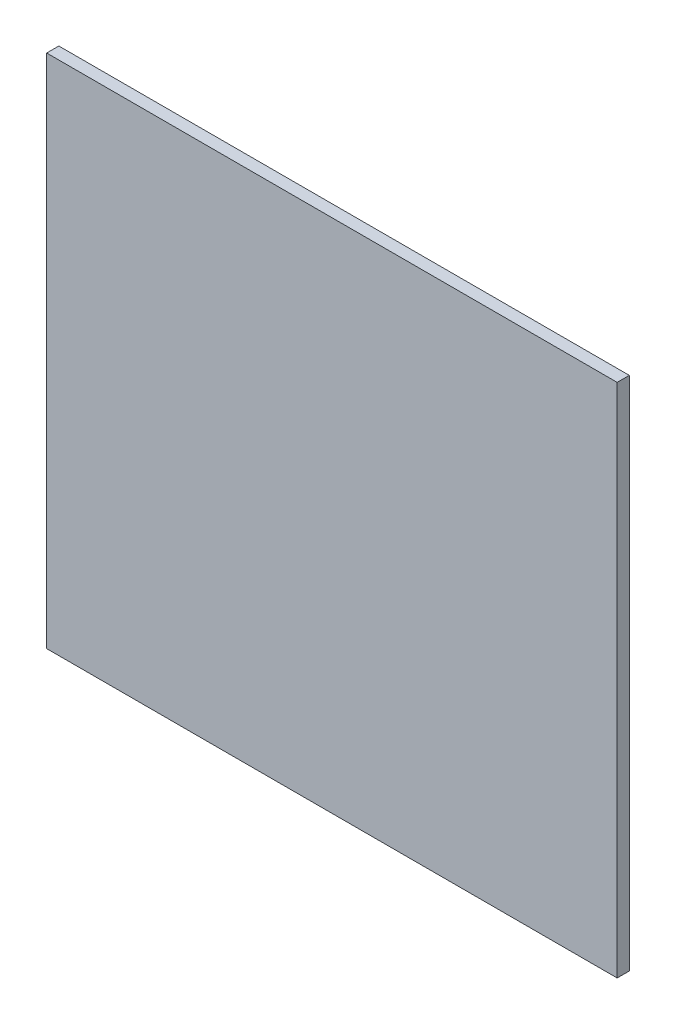
ISO-10303-21;
HEADER;
FILE_DESCRIPTION(('STEP AP214'),'2;1');
FILE_NAME('part.step','',(''),(''),'','','');
FILE_SCHEMA(('AUTOMOTIVE_DESIGN { 1 0 10303 214 1 1 1 1 }'));
ENDSEC;
DATA;
#1=APPLICATION_CONTEXT('core data for automotive mechanical design processes');
#2=APPLICATION_PROTOCOL_DEFINITION('international standard','automotive_design',2000,#1);
#3=PRODUCT_CONTEXT('',#1,'mechanical');
#4=PRODUCT('Part','Part','',(#3));
#5=PRODUCT_RELATED_PRODUCT_CATEGORY('part','',(#4));
#6=PRODUCT_DEFINITION_FORMATION('','',#4);
#7=PRODUCT_DEFINITION_CONTEXT('part definition',#1,'design');
#8=PRODUCT_DEFINITION('design','',#6,#7);
#9=PRODUCT_DEFINITION_SHAPE('','',#8);
#10=(LENGTH_UNIT() NAMED_UNIT(*) SI_UNIT(.MILLI.,.METRE.));
#11=(NAMED_UNIT(*) PLANE_ANGLE_UNIT() SI_UNIT($,.RADIAN.));
#12=(NAMED_UNIT(*) SI_UNIT($,.STERADIAN.) SOLID_ANGLE_UNIT());
#13=UNCERTAINTY_MEASURE_WITH_UNIT(LENGTH_MEASURE(1.E-05),#10,'distance_accuracy_value','');
#14=(GEOMETRIC_REPRESENTATION_CONTEXT(3) GLOBAL_UNCERTAINTY_ASSIGNED_CONTEXT((#13)) GLOBAL_UNIT_ASSIGNED_CONTEXT((#10,
#11,#12)) REPRESENTATION_CONTEXT('',''));
#15=CARTESIAN_POINT('',(0.,0.,0.));
#16=DIRECTION('',(0.,0.,1.));
#17=DIRECTION('',(1.,0.,0.));
#18=AXIS2_PLACEMENT_3D('',#15,#16,#17);
#19=CARTESIAN_POINT('',(0.,0.,1.));
#20=DIRECTION('',(1.,0.,0.));
#21=DIRECTION('',(0.,0.,-1.));
#22=AXIS2_PLACEMENT_3D('',#19,#20,#21);
#23=PLANE('',#22);
#24=DIRECTION('',(0.,-1.,0.));
#25=VECTOR('',#24,1.);
#26=CARTESIAN_POINT('',(0.,0.,0.));
#27=LINE('',#26,#25);
#28=CARTESIAN_POINT('',(0.,42.5,0.));
#29=VERTEX_POINT('',#28);
#30=CARTESIAN_POINT('',(0.,0.,0.));
#31=VERTEX_POINT('',#30);
#32=EDGE_CURVE('E95',#29,#31,#27,.T.);
#33=ORIENTED_EDGE('',*,*,#32,.T.);
#34=DIRECTION('',(0.,0.,-1.));
#35=VECTOR('',#34,1.);
#36=CARTESIAN_POINT('',(0.,0.,1.));
#37=LINE('',#36,#35);
#38=CARTESIAN_POINT('',(0.,0.,1.));
#39=VERTEX_POINT('',#38);
#40=EDGE_CURVE('E11',#39,#31,#37,.T.);
#41=ORIENTED_EDGE('',*,*,#40,.F.);
#42=DIRECTION('',(0.,-1.,0.));
#43=VECTOR('',#42,1.);
#44=CARTESIAN_POINT('',(0.,0.,1.));
#45=LINE('',#44,#43);
#46=CARTESIAN_POINT('',(0.,42.5,1.));
#47=VERTEX_POINT('',#46);
#48=EDGE_CURVE('E83',#47,#39,#45,.T.);
#49=ORIENTED_EDGE('',*,*,#48,.F.);
#50=DIRECTION('',(0.,0.,-1.));
#51=VECTOR('',#50,1.);
#52=CARTESIAN_POINT('',(0.,42.5,1.));
#53=LINE('',#52,#51);
#54=EDGE_CURVE('E91',#47,#29,#53,.T.);
#55=ORIENTED_EDGE('',*,*,#54,.T.);
#56=EDGE_LOOP('',(#33,#41,#49,#55));
#57=FACE_BOUND('',#56,.T.);
#58=ADVANCED_FACE('F32',(#57),#23,.F.);
#59=CARTESIAN_POINT('',(0.,0.,1.));
#60=DIRECTION('',(0.,1.,0.));
#61=DIRECTION('',(0.,0.,1.));
#62=AXIS2_PLACEMENT_3D('',#59,#60,#61);
#63=PLANE('',#62);
#64=DIRECTION('',(1.,0.,0.));
#65=VECTOR('',#64,1.);
#66=CARTESIAN_POINT('',(0.,0.,0.));
#67=LINE('',#66,#65);
#68=CARTESIAN_POINT('',(47.,0.,0.));
#69=VERTEX_POINT('',#68);
#70=EDGE_CURVE('E87',#31,#69,#67,.T.);
#71=ORIENTED_EDGE('',*,*,#70,.T.);
#72=DIRECTION('',(0.,0.,-1.));
#73=VECTOR('',#72,1.);
#74=CARTESIAN_POINT('',(47.,0.,1.));
#75=LINE('',#74,#73);
#76=CARTESIAN_POINT('',(47.,0.,1.));
#77=VERTEX_POINT('',#76);
#78=EDGE_CURVE('E40',#77,#69,#75,.T.);
#79=ORIENTED_EDGE('',*,*,#78,.F.);
#80=DIRECTION('',(1.,0.,0.));
#81=VECTOR('',#80,1.);
#82=CARTESIAN_POINT('',(0.,0.,1.));
#83=LINE('',#82,#81);
#84=EDGE_CURVE('E78',#39,#77,#83,.T.);
#85=ORIENTED_EDGE('',*,*,#84,.F.);
#86=ORIENTED_EDGE('',*,*,#40,.T.);
#87=EDGE_LOOP('',(#71,#79,#85,#86));
#88=FACE_BOUND('',#87,.T.);
#89=ADVANCED_FACE('F86',(#88),#63,.F.);
#90=CARTESIAN_POINT('',(47.,0.,1.));
#91=DIRECTION('',(-1.,0.,0.));
#92=DIRECTION('',(0.,0.,1.));
#93=AXIS2_PLACEMENT_3D('',#90,#91,#92);
#94=PLANE('',#93);
#95=DIRECTION('',(0.,1.,0.));
#96=VECTOR('',#95,1.);
#97=CARTESIAN_POINT('',(47.,0.,0.));
#98=LINE('',#97,#96);
#99=CARTESIAN_POINT('',(47.,42.5,0.));
#100=VERTEX_POINT('',#99);
#101=EDGE_CURVE('E65',#69,#100,#98,.T.);
#102=ORIENTED_EDGE('',*,*,#101,.T.);
#103=DIRECTION('',(0.,0.,-1.));
#104=VECTOR('',#103,1.);
#105=CARTESIAN_POINT('',(47.,42.5,1.));
#106=LINE('',#105,#104);
#107=CARTESIAN_POINT('',(47.,42.5,1.));
#108=VERTEX_POINT('',#107);
#109=EDGE_CURVE('E88',#108,#100,#106,.T.);
#110=ORIENTED_EDGE('',*,*,#109,.F.);
#111=DIRECTION('',(0.,1.,0.));
#112=VECTOR('',#111,1.);
#113=CARTESIAN_POINT('',(47.,0.,1.));
#114=LINE('',#113,#112);
#115=EDGE_CURVE('E81',#77,#108,#114,.T.);
#116=ORIENTED_EDGE('',*,*,#115,.F.);
#117=ORIENTED_EDGE('',*,*,#78,.T.);
#118=EDGE_LOOP('',(#102,#110,#116,#117));
#119=FACE_BOUND('',#118,.T.);
#120=ADVANCED_FACE('F89',(#119),#94,.F.);
#121=CARTESIAN_POINT('',(0.,42.5,1.));
#122=DIRECTION('',(0.,-1.,0.));
#123=DIRECTION('',(0.,0.,-1.));
#124=AXIS2_PLACEMENT_3D('',#121,#122,#123);
#125=PLANE('',#124);
#126=DIRECTION('',(-1.,0.,0.));
#127=VECTOR('',#126,1.);
#128=CARTESIAN_POINT('',(0.,42.5,0.));
#129=LINE('',#128,#127);
#130=EDGE_CURVE('E71',#100,#29,#129,.T.);
#131=ORIENTED_EDGE('',*,*,#130,.T.);
#132=ORIENTED_EDGE('',*,*,#54,.F.);
#133=DIRECTION('',(-1.,0.,0.));
#134=VECTOR('',#133,1.);
#135=CARTESIAN_POINT('',(0.,42.5,1.));
#136=LINE('',#135,#134);
#137=EDGE_CURVE('E48',#108,#47,#136,.T.);
#138=ORIENTED_EDGE('',*,*,#137,.F.);
#139=ORIENTED_EDGE('',*,*,#109,.T.);
#140=EDGE_LOOP('',(#131,#132,#138,#139));
#141=FACE_BOUND('',#140,.T.);
#142=ADVANCED_FACE('F102',(#141),#125,.F.);
#143=CARTESIAN_POINT('',(0.,0.,1.));
#144=DIRECTION('',(0.,0.,-1.));
#145=DIRECTION('',(-1.,0.,0.));
#146=AXIS2_PLACEMENT_3D('',#143,#144,#145);
#147=PLANE('',#146);
#148=ORIENTED_EDGE('',*,*,#48,.T.);
#149=ORIENTED_EDGE('',*,*,#84,.T.);
#150=ORIENTED_EDGE('',*,*,#115,.T.);
#151=ORIENTED_EDGE('',*,*,#137,.T.);
#152=EDGE_LOOP('',(#148,#149,#150,#151));
#153=FACE_BOUND('',#152,.T.);
#154=ADVANCED_FACE('F79',(#153),#147,.F.);
#155=CARTESIAN_POINT('',(0.,0.,0.));
#156=DIRECTION('',(0.,0.,-1.));
#157=DIRECTION('',(-1.,0.,0.));
#158=AXIS2_PLACEMENT_3D('',#155,#156,#157);
#159=PLANE('',#158);
#160=ORIENTED_EDGE('',*,*,#32,.F.);
#161=ORIENTED_EDGE('',*,*,#130,.F.);
#162=ORIENTED_EDGE('',*,*,#101,.F.);
#163=ORIENTED_EDGE('',*,*,#70,.F.);
#164=EDGE_LOOP('',(#160,#161,#162,#163));
#165=FACE_BOUND('',#164,.T.);
#166=ADVANCED_FACE('F105',(#165),#159,.T.);
#167=CLOSED_SHELL('',(#58,#89,#120,#142,#154,#166));
#168=MANIFOLD_SOLID_BREP('B2',#167);
#169=ADVANCED_BREP_SHAPE_REPRESENTATION('',(#18,#168),#14);
#170=SHAPE_DEFINITION_REPRESENTATION(#9,#169);
ENDSEC;
END-ISO-10303-21;
